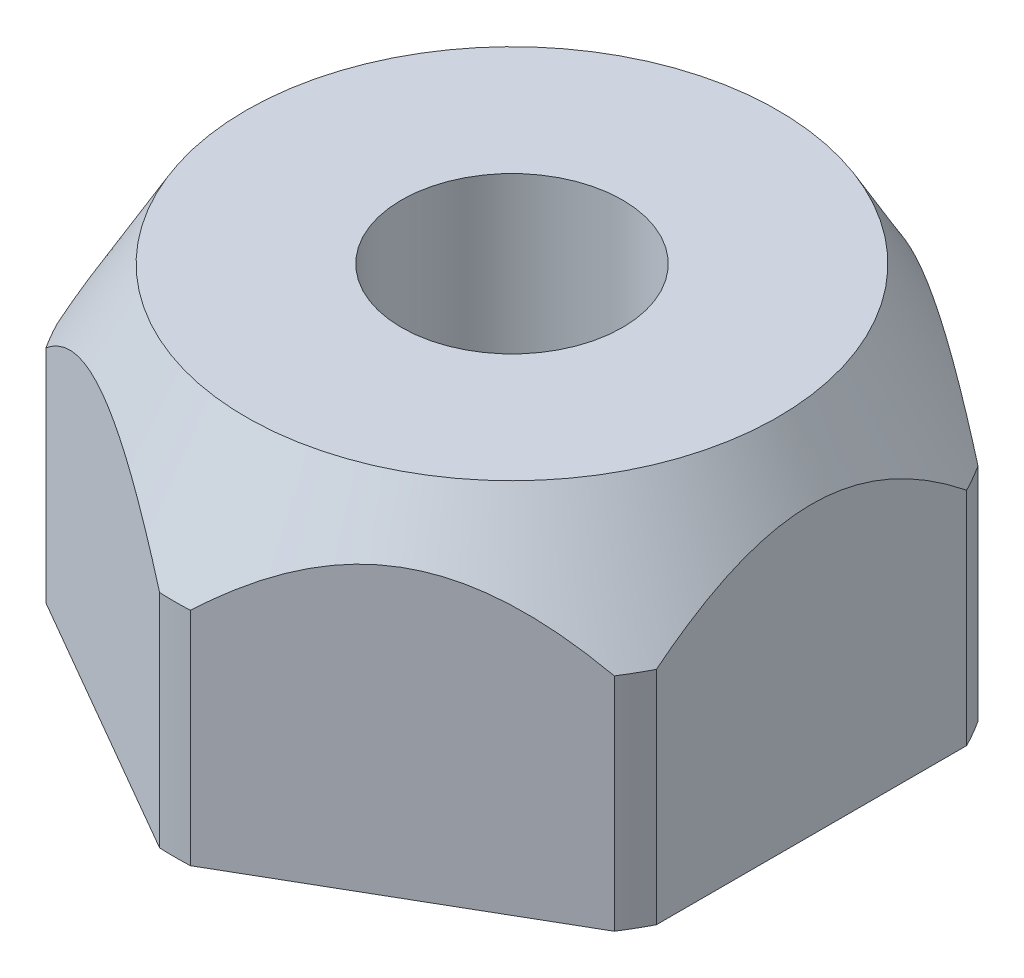
ISO-10303-21;
HEADER;
FILE_DESCRIPTION(('STEP AP214'),'2;1');
FILE_NAME('part.step','',(''),(''),'','','');
FILE_SCHEMA(('AUTOMOTIVE_DESIGN { 1 0 10303 214 1 1 1 1 }'));
ENDSEC;
DATA;
#1=APPLICATION_CONTEXT('core data for automotive mechanical design processes');
#2=APPLICATION_PROTOCOL_DEFINITION('international standard','automotive_design',2000,#1);
#3=PRODUCT_CONTEXT('',#1,'mechanical');
#4=PRODUCT('Part','Part','',(#3));
#5=PRODUCT_RELATED_PRODUCT_CATEGORY('part','',(#4));
#6=PRODUCT_DEFINITION_FORMATION('','',#4);
#7=PRODUCT_DEFINITION_CONTEXT('part definition',#1,'design');
#8=PRODUCT_DEFINITION('design','',#6,#7);
#9=PRODUCT_DEFINITION_SHAPE('','',#8);
#10=(LENGTH_UNIT() NAMED_UNIT(*) SI_UNIT(.MILLI.,.METRE.));
#11=(NAMED_UNIT(*) PLANE_ANGLE_UNIT() SI_UNIT($,.RADIAN.));
#12=(NAMED_UNIT(*) SI_UNIT($,.STERADIAN.) SOLID_ANGLE_UNIT());
#13=UNCERTAINTY_MEASURE_WITH_UNIT(LENGTH_MEASURE(1.E-05),#10,'distance_accuracy_value','');
#14=(GEOMETRIC_REPRESENTATION_CONTEXT(3) GLOBAL_UNCERTAINTY_ASSIGNED_CONTEXT((#13)) GLOBAL_UNIT_ASSIGNED_CONTEXT((#10,
#11,#12)) REPRESENTATION_CONTEXT('',''));
#15=CARTESIAN_POINT('',(0.,0.,0.));
#16=DIRECTION('',(0.,0.,1.));
#17=DIRECTION('',(1.,0.,0.));
#18=AXIS2_PLACEMENT_3D('',#15,#16,#17);
#19=CARTESIAN_POINT('',(0.,4.5212,0.));
#20=DIRECTION('',(0.,1.,0.));
#21=DIRECTION('',(-1.,0.,0.));
#22=AXIS2_PLACEMENT_3D('',#19,#20,#21);
#23=CYLINDRICAL_SURFACE('',#22,4.4196);
#24=DIRECTION('',(0.,1.,0.));
#25=VECTOR('',#24,1.);
#26=CARTESIAN_POINT('',(3.72270396182565,4.5212,-2.38208718828837));
#27=LINE('',#26,#25);
#28=CARTESIAN_POINT('',(3.72270396182565,2.89764571680006,-2.38208718828837));
#29=VERTEX_POINT('',#28);
#30=CARTESIAN_POINT('',(3.72270396182565,0.,-2.38208718828837));
#31=VERTEX_POINT('',#30);
#32=EDGE_CURVE('E202',#29,#31,#27,.F.);
#33=ORIENTED_EDGE('',*,*,#32,.F.);
#34=CARTESIAN_POINT('',(0.,2.89764571680006,0.));
#35=DIRECTION('',(0.,1.,0.));
#36=DIRECTION('',(-1.,0.,0.));
#37=AXIS2_PLACEMENT_3D('',#34,#35,#36);
#38=CIRCLE('',#37,4.4196);
#39=CARTESIAN_POINT('',(3.9243,2.89764571680006,-2.03291260756581));
#40=VERTEX_POINT('',#39);
#41=EDGE_CURVE('E177',#40,#29,#38,.T.);
#42=ORIENTED_EDGE('',*,*,#41,.F.);
#43=DIRECTION('',(0.,1.,0.));
#44=VECTOR('',#43,1.);
#45=CARTESIAN_POINT('',(3.9243,4.5212,-2.03291260756581));
#46=LINE('',#45,#44);
#47=CARTESIAN_POINT('',(3.9243,0.,-2.03291260756581));
#48=VERTEX_POINT('',#47);
#49=EDGE_CURVE('E159',#48,#40,#46,.T.);
#50=ORIENTED_EDGE('',*,*,#49,.F.);
#51=CARTESIAN_POINT('',(0.,0.,0.));
#52=DIRECTION('',(0.,1.,0.));
#53=DIRECTION('',(-1.,0.,0.));
#54=AXIS2_PLACEMENT_3D('',#51,#52,#53);
#55=CIRCLE('',#54,4.4196);
#56=EDGE_CURVE('E175',#48,#31,#55,.T.);
#57=ORIENTED_EDGE('',*,*,#56,.T.);
#58=EDGE_LOOP('',(#33,#42,#50,#57));
#59=FACE_BOUND('',#58,.T.);
#60=ADVANCED_FACE('F44',(#59),#23,.T.);
#61=DIRECTION('',(0.,1.,0.));
#62=VECTOR('',#61,1.);
#63=CARTESIAN_POINT('',(0.201596038174351,4.5212,-4.41499979585417));
#64=LINE('',#63,#62);
#65=CARTESIAN_POINT('',(0.201596038174351,0.,-4.41499979585417));
#66=VERTEX_POINT('',#65);
#67=CARTESIAN_POINT('',(0.201596038174351,2.89764571680006,-4.41499979585417));
#68=VERTEX_POINT('',#67);
#69=EDGE_CURVE('E246',#66,#68,#64,.T.);
#70=ORIENTED_EDGE('',*,*,#69,.F.);
#71=CARTESIAN_POINT('',(-0.201596038174352,0.,-4.41499979585417));
#72=VERTEX_POINT('',#71);
#73=EDGE_CURVE('E187',#66,#72,#55,.T.);
#74=ORIENTED_EDGE('',*,*,#73,.T.);
#75=DIRECTION('',(0.,1.,0.));
#76=VECTOR('',#75,1.);
#77=CARTESIAN_POINT('',(-0.201596038174351,4.5212,-4.41499979585417));
#78=LINE('',#77,#76);
#79=CARTESIAN_POINT('',(-0.201596038174351,2.89764571680006,-4.41499979585417));
#80=VERTEX_POINT('',#79);
#81=EDGE_CURVE('E73',#80,#72,#78,.F.);
#82=ORIENTED_EDGE('',*,*,#81,.F.);
#83=EDGE_CURVE('E322',#68,#80,#38,.T.);
#84=ORIENTED_EDGE('',*,*,#83,.F.);
#85=EDGE_LOOP('',(#70,#74,#82,#84));
#86=FACE_BOUND('',#85,.T.);
#87=ADVANCED_FACE('F284',(#86),#23,.T.);
#88=DIRECTION('',(0.,1.,0.));
#89=VECTOR('',#88,1.);
#90=CARTESIAN_POINT('',(-3.72270396182565,4.5212,-2.38208718828837));
#91=LINE('',#90,#89);
#92=CARTESIAN_POINT('',(-3.72270396182565,0.,-2.38208718828837));
#93=VERTEX_POINT('',#92);
#94=CARTESIAN_POINT('',(-3.72270396182565,2.89764571680006,-2.38208718828837));
#95=VERTEX_POINT('',#94);
#96=EDGE_CURVE('E231',#93,#95,#91,.T.);
#97=ORIENTED_EDGE('',*,*,#96,.F.);
#98=CARTESIAN_POINT('',(-3.9243,0.,-2.0329126075658));
#99=VERTEX_POINT('',#98);
#100=EDGE_CURVE('E195',#93,#99,#55,.T.);
#101=ORIENTED_EDGE('',*,*,#100,.T.);
#102=DIRECTION('',(0.,1.,0.));
#103=VECTOR('',#102,1.);
#104=CARTESIAN_POINT('',(-3.9243,4.5212,-2.0329126075658));
#105=LINE('',#104,#103);
#106=CARTESIAN_POINT('',(-3.9243,2.89764571680006,-2.0329126075658));
#107=VERTEX_POINT('',#106);
#108=EDGE_CURVE('E62',#107,#99,#105,.F.);
#109=ORIENTED_EDGE('',*,*,#108,.F.);
#110=EDGE_CURVE('E215',#95,#107,#38,.T.);
#111=ORIENTED_EDGE('',*,*,#110,.F.);
#112=EDGE_LOOP('',(#97,#101,#109,#111));
#113=FACE_BOUND('',#112,.T.);
#114=ADVANCED_FACE('F237',(#113),#23,.T.);
#115=DIRECTION('',(0.,1.,0.));
#116=VECTOR('',#115,1.);
#117=CARTESIAN_POINT('',(-3.9243,4.5212,2.0329126075658));
#118=LINE('',#117,#116);
#119=CARTESIAN_POINT('',(-3.9243,0.,2.0329126075658));
#120=VERTEX_POINT('',#119);
#121=CARTESIAN_POINT('',(-3.9243,2.89764571680005,2.03291260756582));
#122=VERTEX_POINT('',#121);
#123=EDGE_CURVE('E333',#120,#122,#118,.T.);
#124=ORIENTED_EDGE('',*,*,#123,.F.);
#125=CARTESIAN_POINT('',(-3.72270396182565,0.,2.38208718828837));
#126=VERTEX_POINT('',#125);
#127=EDGE_CURVE('E196',#120,#126,#55,.T.);
#128=ORIENTED_EDGE('',*,*,#127,.T.);
#129=DIRECTION('',(0.,1.,0.));
#130=VECTOR('',#129,1.);
#131=CARTESIAN_POINT('',(-3.72270396182565,4.5212,2.38208718828837));
#132=LINE('',#131,#130);
#133=CARTESIAN_POINT('',(-3.72270396182565,2.89764571680006,2.38208718828837));
#134=VERTEX_POINT('',#133);
#135=EDGE_CURVE('E320',#134,#126,#132,.F.);
#136=ORIENTED_EDGE('',*,*,#135,.F.);
#137=EDGE_CURVE('E169',#122,#134,#38,.T.);
#138=ORIENTED_EDGE('',*,*,#137,.F.);
#139=EDGE_LOOP('',(#124,#128,#136,#138));
#140=FACE_BOUND('',#139,.T.);
#141=ADVANCED_FACE('F295',(#140),#23,.T.);
#142=DIRECTION('',(0.,1.,0.));
#143=VECTOR('',#142,1.);
#144=CARTESIAN_POINT('',(-0.20159603817435,4.5212,4.41499979585417));
#145=LINE('',#144,#143);
#146=CARTESIAN_POINT('',(-0.201596038174349,0.,4.41499979585417));
#147=VERTEX_POINT('',#146);
#148=CARTESIAN_POINT('',(-0.20159603817435,2.89764571680006,4.41499979585417));
#149=VERTEX_POINT('',#148);
#150=EDGE_CURVE('E316',#147,#149,#145,.T.);
#151=ORIENTED_EDGE('',*,*,#150,.F.);
#152=CARTESIAN_POINT('',(0.201596038174345,0.,4.41499979585417));
#153=VERTEX_POINT('',#152);
#154=EDGE_CURVE('E192',#147,#153,#55,.T.);
#155=ORIENTED_EDGE('',*,*,#154,.T.);
#156=DIRECTION('',(0.,1.,0.));
#157=VECTOR('',#156,1.);
#158=CARTESIAN_POINT('',(0.201596038174346,4.5212,4.41499979585417));
#159=LINE('',#158,#157);
#160=CARTESIAN_POINT('',(0.201596038174346,2.89764571680006,4.41499979585417));
#161=VERTEX_POINT('',#160);
#162=EDGE_CURVE('E305',#161,#153,#159,.F.);
#163=ORIENTED_EDGE('',*,*,#162,.F.);
#164=EDGE_CURVE('E218',#149,#161,#38,.T.);
#165=ORIENTED_EDGE('',*,*,#164,.F.);
#166=EDGE_LOOP('',(#151,#155,#163,#165));
#167=FACE_BOUND('',#166,.T.);
#168=ADVANCED_FACE('F290',(#167),#23,.T.);
#169=DIRECTION('',(0.,1.,0.));
#170=VECTOR('',#169,1.);
#171=CARTESIAN_POINT('',(3.72270396182565,4.5212,2.38208718828837));
#172=LINE('',#171,#170);
#173=CARTESIAN_POINT('',(3.72270396182565,0.,2.38208718828837));
#174=VERTEX_POINT('',#173);
#175=CARTESIAN_POINT('',(3.72270396182565,2.89764571680006,2.38208718828837));
#176=VERTEX_POINT('',#175);
#177=EDGE_CURVE('E299',#174,#176,#172,.T.);
#178=ORIENTED_EDGE('',*,*,#177,.F.);
#179=CARTESIAN_POINT('',(3.9243,0.,2.03291260756581));
#180=VERTEX_POINT('',#179);
#181=EDGE_CURVE('E186',#174,#180,#55,.T.);
#182=ORIENTED_EDGE('',*,*,#181,.T.);
#183=DIRECTION('',(0.,1.,0.));
#184=VECTOR('',#183,1.);
#185=CARTESIAN_POINT('',(3.9243,4.5212,2.03291260756581));
#186=LINE('',#185,#184);
#187=CARTESIAN_POINT('',(3.9243,2.89764571680005,2.03291260756583));
#188=VERTEX_POINT('',#187);
#189=EDGE_CURVE('E162',#188,#180,#186,.F.);
#190=ORIENTED_EDGE('',*,*,#189,.F.);
#191=EDGE_CURVE('E301',#176,#188,#38,.T.);
#192=ORIENTED_EDGE('',*,*,#191,.F.);
#193=EDGE_LOOP('',(#178,#182,#190,#192));
#194=FACE_BOUND('',#193,.T.);
#195=ADVANCED_FACE('F46',(#194),#23,.T.);
#196=CARTESIAN_POINT('',(0.,4.5212,0.));
#197=DIRECTION('',(0.,-1.,0.));
#198=DIRECTION('',(1.,0.,0.));
#199=AXIS2_PLACEMENT_3D('',#196,#197,#198);
#200=CONICAL_SURFACE('',#199,3.48224049755053,0.523598775598307);
#201=CARTESIAN_POINT('',(0.201378646395307,2.89744571680006,-4.41512530705632));
#202=CARTESIAN_POINT('',(0.243002688833909,2.93573712645072,-4.39109365494964));
#203=CARTESIAN_POINT('',(0.285074251898576,2.97337922098922,-4.36680362668902));
#204=CARTESIAN_POINT('',(0.370206681949156,3.04717777314053,-4.31765239528255));
#205=CARTESIAN_POINT('',(0.413267908892586,3.08333367642834,-4.29279098431513));
#206=CARTESIAN_POINT('',(0.544599933654743,3.18971037495322,-4.21696640446548));
#207=CARTESIAN_POINT('',(0.634477673899376,3.25733473471823,-4.16507546694109));
#208=CARTESIAN_POINT('',(0.821144915873365,3.38487757851598,-4.05730308453852));
#209=CARTESIAN_POINT('',(0.918046421063457,3.44458078367558,-4.00135697443214));
#210=CARTESIAN_POINT('',(1.11680543627588,3.55102543367785,-3.88660340349538));
#211=CARTESIAN_POINT('',(1.218647548972,3.59780444515529,-3.82780483231544));
#212=CARTESIAN_POINT('',(1.43529451423899,3.67787617965486,-3.70272364859942));
#213=CARTESIAN_POINT('',(1.55048857316493,3.70981655679631,-3.63621632766949));
#214=CARTESIAN_POINT('',(1.78281413271054,3.74995513125242,-3.5020831033262));
#215=CARTESIAN_POINT('',(1.89991230733974,3.7584005945101,-3.43447644068241));
#216=CARTESIAN_POINT('',(2.13361293691471,3.75090530137457,-3.29954931928752));
#217=CARTESIAN_POINT('',(2.2502147736126,3.73493996899139,-3.23222921748199));
#218=CARTESIAN_POINT('',(2.4806112780335,3.68075542544333,-3.09920973363423));
#219=CARTESIAN_POINT('',(2.59436313462659,3.64230230903893,-3.0335350686094));
#220=CARTESIAN_POINT('',(2.79918417335044,3.55483104413837,-2.91528158676648));
#221=CARTESIAN_POINT('',(2.89107892955647,3.50829606479648,-2.86222612453382));
#222=CARTESIAN_POINT('',(3.07070088952971,3.40515033107087,-2.75852133759089));
#223=CARTESIAN_POINT('',(3.1584193246077,3.34851946739325,-2.70787707548573));
#224=CARTESIAN_POINT('',(3.32771219466592,3.22903572151362,-2.61013579138573));
#225=CARTESIAN_POINT('',(3.40938284458361,3.16636154115019,-2.56298321967086));
#226=CARTESIAN_POINT('',(3.56883955872649,3.03560761551068,-2.47092084283637));
#227=CARTESIAN_POINT('',(3.64664238475491,2.96755525608414,-2.42600136028515));
#228=CARTESIAN_POINT('',(3.7229213536047,2.89744571680005,-2.38196167708622));
#229=B_SPLINE_CURVE_WITH_KNOTS('',3,(#201,#202,#203,#204,#205,#206,#207,#208,#209,#210,#211,
#212,#213,#214,#215,#216,#217,#218,#219,#220,#221,#222,#223,#224,#225,#226,#227,#228),
.UNSPECIFIED.,.F.,.F.,(4,2,2,2,2,2,2,2,2,2,2,2,2,4),(0.,0.184345090143029,0.368758325377625,
0.739992068313383,1.11984200873029,1.49857594003078,1.90713875884581,2.3113852005117,
2.71603889232377,3.12497836793815,3.4719638581063,3.81964836787163,4.15911497599774,
4.49695241990035),.UNSPECIFIED.);
#230=EDGE_CURVE('E250',#68,#29,#229,.T.);
#231=ORIENTED_EDGE('',*,*,#230,.F.);
#232=ORIENTED_EDGE('',*,*,#83,.T.);
#233=CARTESIAN_POINT('',(-3.7229213536047,2.89744571680005,-2.38196167708622));
#234=CARTESIAN_POINT('',(-3.6812973111661,2.93573712645071,-2.4059933291929));
#235=CARTESIAN_POINT('',(-3.63922574810143,2.97337922098922,-2.43028335745352));
#236=CARTESIAN_POINT('',(-3.55409331805085,3.04717777314052,-2.47943458885999));
#237=CARTESIAN_POINT('',(-3.51103209110742,3.08333367642834,-2.50429599982741));
#238=CARTESIAN_POINT('',(-3.37970006634527,3.18971037495322,-2.58012057967706));
#239=CARTESIAN_POINT('',(-3.28982232610063,3.25733473471822,-2.63201151720146));
#240=CARTESIAN_POINT('',(-3.10315508412664,3.38487757851598,-2.73978389960402));
#241=CARTESIAN_POINT('',(-3.00625357893655,3.44458078367558,-2.7957300097104));
#242=CARTESIAN_POINT('',(-2.80749456372413,3.55102543367784,-2.91048358064716));
#243=CARTESIAN_POINT('',(-2.70565245102801,3.59780444515529,-2.9692821518271));
#244=CARTESIAN_POINT('',(-2.48900548576102,3.67787617965485,-3.09436333554312));
#245=CARTESIAN_POINT('',(-2.37381142683508,3.70981655679631,-3.16087065647305));
#246=CARTESIAN_POINT('',(-2.14148586728947,3.74995513125242,-3.29500388081634));
#247=CARTESIAN_POINT('',(-2.02438769266027,3.7584005945101,-3.36261054346013));
#248=CARTESIAN_POINT('',(-1.7906870630853,3.75090530137457,-3.49753766485502));
#249=CARTESIAN_POINT('',(-1.67408522638741,3.7349399689914,-3.56485776666055));
#250=CARTESIAN_POINT('',(-1.44368872196651,3.68075542544333,-3.69787725050831));
#251=CARTESIAN_POINT('',(-1.32993686537342,3.64230230903893,-3.76355191553314));
#252=CARTESIAN_POINT('',(-1.12511582664957,3.55483104413837,-3.88180539737606));
#253=CARTESIAN_POINT('',(-1.03322107044354,3.50829606479649,-3.93486085960873));
#254=CARTESIAN_POINT('',(-0.853599110470297,3.40515033107087,-4.03856564655165));
#255=CARTESIAN_POINT('',(-0.765880675392313,3.34851946739326,-4.08920990865681));
#256=CARTESIAN_POINT('',(-0.596587805334092,3.22903572151363,-4.18695119275681));
#257=CARTESIAN_POINT('',(-0.514917155416397,3.1663615411502,-4.23410376447168));
#258=CARTESIAN_POINT('',(-0.355460441273519,3.03560761551069,-4.32616614130617));
#259=CARTESIAN_POINT('',(-0.277657615245102,2.96755525608415,-4.37108562385739));
#260=CARTESIAN_POINT('',(-0.201378646395307,2.89744571680006,-4.41512530705632));
#261=B_SPLINE_CURVE_WITH_KNOTS('',3,(#233,#234,#235,#236,#237,#238,#239,#240,#241,#242,#243,
#244,#245,#246,#247,#248,#249,#250,#251,#252,#253,#254,#255,#256,#257,#258,#259,#260),
.UNSPECIFIED.,.F.,.F.,(4,2,2,2,2,2,2,2,2,2,2,2,2,4),(0.,0.184345090143029,0.368758325377625,
0.739992068313384,1.11984200873029,1.49857594003079,1.90713875884581,2.31138520051171,
2.71603889232377,3.12497836793816,3.4719638581063,3.81964836787163,4.15911497599774,
4.49695241990034),.UNSPECIFIED.);
#262=EDGE_CURVE('E240',#95,#80,#261,.T.);
#263=ORIENTED_EDGE('',*,*,#262,.F.);
#264=ORIENTED_EDGE('',*,*,#110,.T.);
#265=CARTESIAN_POINT('',(-3.9243,-5.87380782557374,-8.63379129520373));
#266=CARTESIAN_POINT('',(-3.9243,-5.58964286938288,-8.45355593513878));
#267=CARTESIAN_POINT('',(-3.9243,-5.30589522438469,-8.27265816557873));
#268=CARTESIAN_POINT('',(-3.9243,-4.73944838253155,-7.90919357757867));
#269=CARTESIAN_POINT('',(-3.9243,-4.45674924687053,-7.72662666381215));
#270=CARTESIAN_POINT('',(-3.9243,-3.89179400145961,-7.35894572743985));
#271=CARTESIAN_POINT('',(-3.9243,-3.60954180925933,-7.17382567678761));
#272=CARTESIAN_POINT('',(-3.9243,-3.04668309623803,-6.80111721439275));
#273=CARTESIAN_POINT('',(-3.9243,-2.76607652358586,-6.61352888100245));
#274=CARTESIAN_POINT('',(-3.9243,-2.17874914148297,-6.21618149631846));
#275=CARTESIAN_POINT('',(-3.9243,-1.8722493542194,-6.00609478205519));
#276=CARTESIAN_POINT('',(-3.9243,-1.2626331318594,-5.58099180262799));
#277=CARTESIAN_POINT('',(-3.9243,-0.959517050733292,-5.36597502878301));
#278=CARTESIAN_POINT('',(-3.9243,-0.35855230177701,-4.92970380860127));
#279=CARTESIAN_POINT('',(-3.9243,-0.060695582010741,-4.70846054388232));
#280=CARTESIAN_POINT('',(-3.9243,0.380757835234389,-4.36969669549216));
#281=CARTESIAN_POINT('',(-3.9243,0.527008292446811,-4.25563546669555));
#282=CARTESIAN_POINT('',(-3.9243,0.817287951568911,-4.02472547436633));
#283=CARTESIAN_POINT('',(-3.9243,0.961317270900784,-3.90787685902861));
#284=CARTESIAN_POINT('',(-3.9243,1.20900848594877,-3.70200165467747));
#285=CARTESIAN_POINT('',(-3.9243,1.31331413034915,-3.61375017193311));
#286=CARTESIAN_POINT('',(-3.9243,1.52007701334346,-3.43509629501821));
#287=CARTESIAN_POINT('',(-3.9243,1.62253419982915,-3.34469384037758));
#288=CARTESIAN_POINT('',(-3.9243,1.82537344432241,-3.16119172938196));
#289=CARTESIAN_POINT('',(-3.9243,1.92575108110659,-3.06808717133467));
#290=CARTESIAN_POINT('',(-3.9243,2.12365413528848,-2.87889417516989));
#291=CARTESIAN_POINT('',(-3.9243,2.22117972595293,-2.7828059190515));
#292=CARTESIAN_POINT('',(-3.9243,2.41081224427405,-2.5889155437287));
#293=CARTESIAN_POINT('',(-3.9243,2.50298659907945,-2.49117968490803));
#294=CARTESIAN_POINT('',(-3.9243,2.68287198547388,-2.29160114585912));
#295=CARTESIAN_POINT('',(-3.9243,2.77058166928826,-2.18975724194887));
#296=CARTESIAN_POINT('',(-3.9243,2.93981076454091,-1.98155789228631));
#297=CARTESIAN_POINT('',(-3.9243,3.02134917254444,-1.87521800513253));
#298=CARTESIAN_POINT('',(-3.9243,3.17649864518206,-1.65694963490632));
#299=CARTESIAN_POINT('',(-3.9243,3.25011654126105,-1.54502609171099));
#300=CARTESIAN_POINT('',(-3.9243,3.35948778615387,-1.36056405232588));
#301=CARTESIAN_POINT('',(-3.9243,3.3986581290361,-1.29005960112683));
#302=CARTESIAN_POINT('',(-3.9243,3.47231673158247,-1.14664541023704));
#303=CARTESIAN_POINT('',(-3.9243,3.50680414548727,-1.07373523900949));
#304=CARTESIAN_POINT('',(-3.9243,3.6017037872312,-0.85169513625506));
#305=CARTESIAN_POINT('',(-3.9243,3.65384598832468,-0.698783402481794));
#306=CARTESIAN_POINT('',(-3.9243,3.72125862440976,-0.414375721124633));
#307=CARTESIAN_POINT('',(-3.9243,3.74153228763838,-0.284085210312981));
#308=CARTESIAN_POINT('',(-3.9243,3.75920323472214,-0.0218768313064437));
#309=CARTESIAN_POINT('',(-3.9243,3.75660117281652,0.110040990240066));
#310=CARTESIAN_POINT('',(-3.9243,3.72894702535028,0.371034328665205));
#311=CARTESIAN_POINT('',(-3.9243,3.7039555252625,0.500116553480642));
#312=CARTESIAN_POINT('',(-3.9243,3.63493261062312,0.7529780698682));
#313=CARTESIAN_POINT('',(-3.9243,3.59089182871347,0.876754719503425));
#314=CARTESIAN_POINT('',(-3.9243,3.49432043207937,1.10314912209663));
#315=CARTESIAN_POINT('',(-3.9243,3.44347694361856,1.20650790848841));
#316=CARTESIAN_POINT('',(-3.9243,3.33293331391539,1.40842680911294));
#317=CARTESIAN_POINT('',(-3.9243,3.27322584092506,1.50698286031848));
#318=CARTESIAN_POINT('',(-3.9243,3.14635490565401,1.70065780687327));
#319=CARTESIAN_POINT('',(-3.9243,3.07911730261507,1.79572756015731));
#320=CARTESIAN_POINT('',(-3.9243,2.939351909161,1.98179076211418));
#321=CARTESIAN_POINT('',(-3.9243,2.86682665414167,2.07278613108027));
#322=CARTESIAN_POINT('',(-3.9243,2.72226307027854,2.24575017492362));
#323=CARTESIAN_POINT('',(-3.9243,2.65047395227167,2.32792855558461));
#324=CARTESIAN_POINT('',(-3.9243,2.50395662346823,2.48962939161582));
#325=CARTESIAN_POINT('',(-3.9243,2.42922801787163,2.56915148755219));
#326=CARTESIAN_POINT('',(-3.9243,2.20139453856917,2.80437018757481));
#327=CARTESIAN_POINT('',(-3.9243,2.04472951561085,2.95661718807237));
#328=CARTESIAN_POINT('',(-3.9243,1.72436552397984,3.25466769588499));
#329=CARTESIAN_POINT('',(-3.9243,1.56064217265613,3.40044462879705));
#330=CARTESIAN_POINT('',(-3.9243,1.2285037793297,3.6865751897645));
#331=CARTESIAN_POINT('',(-3.9243,1.06008811012746,3.82692808677206));
#332=CARTESIAN_POINT('',(-3.9243,0.733968216819453,4.09183149253688));
#333=CARTESIAN_POINT('',(-3.9243,0.57654059248636,4.21672433969304));
#334=CARTESIAN_POINT('',(-3.9243,0.259385992588557,4.46358469856286));
#335=CARTESIAN_POINT('',(-3.9243,0.0996587755311476,4.58555189939948));
#336=CARTESIAN_POINT('',(-3.9243,-0.22017094037556,4.82597958614242));
#337=CARTESIAN_POINT('',(-3.9243,-0.380257212293098,4.94446171729388));
#338=CARTESIAN_POINT('',(-3.9243,-0.701864312356236,5.17939164760606));
#339=CARTESIAN_POINT('',(-3.9243,-0.8633848263716,5.295839876429));
#340=CARTESIAN_POINT('',(-3.9243,-1.02548199442387,5.41146916723737));
#341=B_SPLINE_CURVE_WITH_KNOTS('',3,(#265,#266,#267,#268,#269,#270,#271,#272,#273,#274,#275,
#276,#277,#278,#279,#280,#281,#282,#283,#284,#285,#286,#287,#288,#289,#290,#291,#292,#293,#294,
#295,#296,#297,#298,#299,#300,#301,#302,#303,#304,#305,#306,#307,#308,#309,#310,#311,#312,#313,
#314,#315,#316,#317,#318,#319,#320,#321,#322,#323,#324,#325,#326,#327,#328,#329,#330,#331,#332,
#333,#334,#335,#336,#337,#338,#339,#340),.UNSPECIFIED.,.F.,.F.,(4,2,2,2,2,2,2,2,2,2,2,2,2,2,2,2,
2,2,2,2,2,2,2,2,2,2,2,2,2,2,2,2,2,2,2,2,2,4),(0.,1.00951269066253,2.01908340031431,
3.03170361538688,4.04429176336791,5.1590217229326,6.27386722200635,7.38682449596562,
7.94320958840621,8.49956516557767,8.90943405719607,9.31931448507023,9.72999171618565,
10.1406439458991,10.5435698771038,10.9466167290678,11.3483676832058,11.7497693011965,
11.9915734636186,12.2334212391062,12.7154641153318,13.1092420405207,13.5030087038095,
13.8957130483039,14.2886107224912,14.633659408222,14.9789951039688,15.3280929568146,
15.6770245065828,16.0042971625776,16.3316139253778,16.9866499157622,17.6441656189178,
18.3017696347011,18.9045859362486,19.5074660113789,20.1049366045304,20.7022794169288),.UNSPECIFIED.);
#342=EDGE_CURVE('E330',#122,#107,#341,.F.);
#343=ORIENTED_EDGE('',*,*,#342,.F.);
#344=ORIENTED_EDGE('',*,*,#137,.T.);
#345=CARTESIAN_POINT('',(-0.201378646395305,2.89744571680006,4.41512530705632));
#346=CARTESIAN_POINT('',(-0.243002688833907,2.93573712645072,4.39109365494964));
#347=CARTESIAN_POINT('',(-0.285074251898573,2.97337922098922,4.36680362668902));
#348=CARTESIAN_POINT('',(-0.370206681949154,3.04717777314053,4.31765239528255));
#349=CARTESIAN_POINT('',(-0.413267908892583,3.08333367642834,4.29279098431513));
#350=CARTESIAN_POINT('',(-0.544599933654741,3.18971037495322,4.21696640446548));
#351=CARTESIAN_POINT('',(-0.634477673899374,3.25733473471823,4.16507546694109));
#352=CARTESIAN_POINT('',(-0.821144915873363,3.38487757851598,4.05730308453852));
#353=CARTESIAN_POINT('',(-0.918046421063455,3.44458078367558,4.00135697443214));
#354=CARTESIAN_POINT('',(-1.11680543627588,3.55102543367785,3.88660340349538));
#355=CARTESIAN_POINT('',(-1.218647548972,3.59780444515529,3.82780483231544));
#356=CARTESIAN_POINT('',(-1.43529451423899,3.67787617965486,3.70272364859942));
#357=CARTESIAN_POINT('',(-1.55048857316493,3.70981655679631,3.63621632766949));
#358=CARTESIAN_POINT('',(-1.78281413271054,3.74995513125242,3.5020831033262));
#359=CARTESIAN_POINT('',(-1.89991230733974,3.7584005945101,3.43447644068242));
#360=CARTESIAN_POINT('',(-2.13361293691471,3.75090530137457,3.29954931928752));
#361=CARTESIAN_POINT('',(-2.2502147736126,3.7349399689914,3.23222921748199));
#362=CARTESIAN_POINT('',(-2.4806112780335,3.68075542544333,3.09920973363423));
#363=CARTESIAN_POINT('',(-2.59436313462658,3.64230230903892,3.0335350686094));
#364=CARTESIAN_POINT('',(-2.79918417335044,3.55483104413836,2.91528158676648));
#365=CARTESIAN_POINT('',(-2.89107892955647,3.50829606479648,2.86222612453382));
#366=CARTESIAN_POINT('',(-3.07070088952971,3.40515033107087,2.75852133759089));
#367=CARTESIAN_POINT('',(-3.1584193246077,3.34851946739325,2.70787707548573));
#368=CARTESIAN_POINT('',(-3.32771219466592,3.22903572151362,2.61013579138573));
#369=CARTESIAN_POINT('',(-3.40938284458361,3.16636154115019,2.56298321967086));
#370=CARTESIAN_POINT('',(-3.56883955872649,3.03560761551068,2.47092084283637));
#371=CARTESIAN_POINT('',(-3.64664238475491,2.96755525608414,2.42600136028515));
#372=CARTESIAN_POINT('',(-3.7229213536047,2.89744571680005,2.38196167708622));
#373=B_SPLINE_CURVE_WITH_KNOTS('',3,(#345,#346,#347,#348,#349,#350,#351,#352,#353,#354,#355,
#356,#357,#358,#359,#360,#361,#362,#363,#364,#365,#366,#367,#368,#369,#370,#371,#372),
.UNSPECIFIED.,.F.,.F.,(4,2,2,2,2,2,2,2,2,2,2,2,2,4),(0.,0.184345090143029,0.368758325377624,
0.739992068313383,1.11984200873029,1.49857594003079,1.90713875884581,2.3113852005117,
2.71603889232377,3.12497836793815,3.4719638581063,3.81964836787163,4.15911497599774,
4.49695241990035),.UNSPECIFIED.);
#374=EDGE_CURVE('E319',#149,#134,#373,.T.);
#375=ORIENTED_EDGE('',*,*,#374,.F.);
#376=ORIENTED_EDGE('',*,*,#164,.T.);
#377=CARTESIAN_POINT('',(3.72292135360471,2.89744571680005,2.38196167708621));
#378=CARTESIAN_POINT('',(3.6812973111661,2.93573712645071,2.4059933291929));
#379=CARTESIAN_POINT('',(3.63922574810144,2.97337922098922,2.43028335745351));
#380=CARTESIAN_POINT('',(3.55409331805086,3.04717777314052,2.47943458885998));
#381=CARTESIAN_POINT('',(3.51103209110743,3.08333367642834,2.50429599982741));
#382=CARTESIAN_POINT('',(3.37970006634527,3.18971037495322,2.58012057967706));
#383=CARTESIAN_POINT('',(3.28982232610064,3.25733473471822,2.63201151720145));
#384=CARTESIAN_POINT('',(3.10315508412665,3.38487757851598,2.73978389960402));
#385=CARTESIAN_POINT('',(3.00625357893656,3.44458078367558,2.7957300097104));
#386=CARTESIAN_POINT('',(2.80749456372413,3.55102543367785,2.91048358064716));
#387=CARTESIAN_POINT('',(2.70565245102802,3.59780444515529,2.9692821518271));
#388=CARTESIAN_POINT('',(2.48900548576102,3.67787617965486,3.09436333554311));
#389=CARTESIAN_POINT('',(2.37381142683508,3.70981655679631,3.16087065647305));
#390=CARTESIAN_POINT('',(2.14148586728947,3.74995513125242,3.29500388081634));
#391=CARTESIAN_POINT('',(2.02438769266027,3.7584005945101,3.36261054346012));
#392=CARTESIAN_POINT('',(1.7906870630853,3.75090530137457,3.49753766485501));
#393=CARTESIAN_POINT('',(1.67408522638741,3.7349399689914,3.56485776666055));
#394=CARTESIAN_POINT('',(1.44368872196651,3.68075542544334,3.6978772505083));
#395=CARTESIAN_POINT('',(1.32993686537343,3.64230230903893,3.76355191553314));
#396=CARTESIAN_POINT('',(1.12511582664957,3.55483104413837,3.88180539737606));
#397=CARTESIAN_POINT('',(1.03322107044354,3.50829606479649,3.93486085960872));
#398=CARTESIAN_POINT('',(0.853599110470297,3.40515033107088,4.03856564655164));
#399=CARTESIAN_POINT('',(0.765880675392313,3.34851946739326,4.08920990865681));
#400=CARTESIAN_POINT('',(0.596587805334091,3.22903572151363,4.18695119275681));
#401=CARTESIAN_POINT('',(0.514917155416395,3.1663615411502,4.23410376447168));
#402=CARTESIAN_POINT('',(0.355460441273515,3.03560761551069,4.32616614130617));
#403=CARTESIAN_POINT('',(0.277657615245097,2.96755525608415,4.37108562385739));
#404=CARTESIAN_POINT('',(0.201378646395302,2.89744571680006,4.41512530705632));
#405=B_SPLINE_CURVE_WITH_KNOTS('',3,(#377,#378,#379,#380,#381,#382,#383,#384,#385,#386,#387,
#388,#389,#390,#391,#392,#393,#394,#395,#396,#397,#398,#399,#400,#401,#402,#403,#404),
.UNSPECIFIED.,.F.,.F.,(4,2,2,2,2,2,2,2,2,2,2,2,2,4),(0.,0.184345090143029,0.368758325377625,
0.739992068313384,1.11984200873029,1.49857594003079,1.90713875884581,2.3113852005117,
2.71603889232377,3.12497836793816,3.4719638581063,3.81964836787163,4.15911497599774,
4.49695241990036),.UNSPECIFIED.);
#406=EDGE_CURVE('E306',#176,#161,#405,.T.);
#407=ORIENTED_EDGE('',*,*,#406,.F.);
#408=ORIENTED_EDGE('',*,*,#191,.T.);
#409=CARTESIAN_POINT('',(3.9243,-5.87380782557374,-8.63379129520373));
#410=CARTESIAN_POINT('',(3.9243,-5.58964286938288,-8.45355593513878));
#411=CARTESIAN_POINT('',(3.9243,-5.30589522438469,-8.27265816557873));
#412=CARTESIAN_POINT('',(3.9243,-4.73944838253155,-7.90919357757867));
#413=CARTESIAN_POINT('',(3.9243,-4.45674924687053,-7.72662666381215));
#414=CARTESIAN_POINT('',(3.9243,-3.89179400145961,-7.35894572743985));
#415=CARTESIAN_POINT('',(3.9243,-3.60954180925933,-7.17382567678761));
#416=CARTESIAN_POINT('',(3.9243,-3.04668309623803,-6.80111721439275));
#417=CARTESIAN_POINT('',(3.9243,-2.76607652358586,-6.61352888100245));
#418=CARTESIAN_POINT('',(3.9243,-2.17874914148296,-6.21618149631846));
#419=CARTESIAN_POINT('',(3.9243,-1.87224935421939,-6.00609478205518));
#420=CARTESIAN_POINT('',(3.9243,-1.26263313185939,-5.58099180262798));
#421=CARTESIAN_POINT('',(3.9243,-0.959517050733282,-5.365975028783));
#422=CARTESIAN_POINT('',(3.9243,-0.358552301776998,-4.92970380860126));
#423=CARTESIAN_POINT('',(3.9243,-0.0606955820107287,-4.70846054388231));
#424=CARTESIAN_POINT('',(3.9243,0.380757835234403,-4.36969669549215));
#425=CARTESIAN_POINT('',(3.9243,0.527008292446825,-4.25563546669554));
#426=CARTESIAN_POINT('',(3.9243,0.817287951568927,-4.02472547436632));
#427=CARTESIAN_POINT('',(3.9243,0.9613172709008,-3.9078768590286));
#428=CARTESIAN_POINT('',(3.9243,1.20900848594879,-3.70200165467746));
#429=CARTESIAN_POINT('',(3.9243,1.31331413034917,-3.6137501719331));
#430=CARTESIAN_POINT('',(3.9243,1.52007701334348,-3.4350962950182));
#431=CARTESIAN_POINT('',(3.9243,1.62253419982916,-3.34469384037757));
#432=CARTESIAN_POINT('',(3.9243,1.82537344432242,-3.16119172938195));
#433=CARTESIAN_POINT('',(3.9243,1.9257510811066,-3.06808717133467));
#434=CARTESIAN_POINT('',(3.9243,2.12365413528849,-2.87889417516988));
#435=CARTESIAN_POINT('',(3.9243,2.22117972595294,-2.7828059190515));
#436=CARTESIAN_POINT('',(3.9243,2.41081224427406,-2.5889155437287));
#437=CARTESIAN_POINT('',(3.9243,2.50298659907946,-2.49117968490802));
#438=CARTESIAN_POINT('',(3.9243,2.68287198547389,-2.29160114585911));
#439=CARTESIAN_POINT('',(3.9243,2.77058166928827,-2.18975724194887));
#440=CARTESIAN_POINT('',(3.9243,2.93981076454091,-1.98155789228631));
#441=CARTESIAN_POINT('',(3.9243,3.02134917254445,-1.87521800513252));
#442=CARTESIAN_POINT('',(3.9243,3.17649864518207,-1.65694963490632));
#443=CARTESIAN_POINT('',(3.9243,3.25011654126105,-1.54502609171099));
#444=CARTESIAN_POINT('',(3.9243,3.35948778615387,-1.36056405232588));
#445=CARTESIAN_POINT('',(3.9243,3.39865812903611,-1.29005960112683));
#446=CARTESIAN_POINT('',(3.9243,3.47231673158247,-1.14664541023704));
#447=CARTESIAN_POINT('',(3.9243,3.50680414548727,-1.07373523900949));
#448=CARTESIAN_POINT('',(3.9243,3.6017037872312,-0.851695136255063));
#449=CARTESIAN_POINT('',(3.9243,3.65384598832468,-0.698783402481796));
#450=CARTESIAN_POINT('',(3.9243,3.72125862440976,-0.414375721124635));
#451=CARTESIAN_POINT('',(3.9243,3.74153228763838,-0.284085210312983));
#452=CARTESIAN_POINT('',(3.9243,3.75920323472215,-0.0218768313064456));
#453=CARTESIAN_POINT('',(3.9243,3.75660117281652,0.110040990240064));
#454=CARTESIAN_POINT('',(3.9243,3.72894702535029,0.371034328665203));
#455=CARTESIAN_POINT('',(3.9243,3.70395552526251,0.50011655348064));
#456=CARTESIAN_POINT('',(3.9243,3.63493261062312,0.752978069868198));
#457=CARTESIAN_POINT('',(3.9243,3.59089182871347,0.876754719503423));
#458=CARTESIAN_POINT('',(3.9243,3.49432043207938,1.10314912209662));
#459=CARTESIAN_POINT('',(3.9243,3.44347694361857,1.20650790848841));
#460=CARTESIAN_POINT('',(3.9243,3.3329333139154,1.40842680911294));
#461=CARTESIAN_POINT('',(3.9243,3.27322584092506,1.50698286031847));
#462=CARTESIAN_POINT('',(3.9243,3.14635490565401,1.70065780687327));
#463=CARTESIAN_POINT('',(3.9243,3.07911730261507,1.79572756015731));
#464=CARTESIAN_POINT('',(3.9243,2.939351909161,1.98179076211418));
#465=CARTESIAN_POINT('',(3.9243,2.86682665414167,2.07278613108027));
#466=CARTESIAN_POINT('',(3.9243,2.72226307027855,2.24575017492362));
#467=CARTESIAN_POINT('',(3.9243,2.65047395227167,2.3279285555846));
#468=CARTESIAN_POINT('',(3.9243,2.50395662346824,2.48962939161582));
#469=CARTESIAN_POINT('',(3.9243,2.42922801787164,2.56915148755219));
#470=CARTESIAN_POINT('',(3.9243,2.20139453856917,2.80437018757481));
#471=CARTESIAN_POINT('',(3.9243,2.04472951561086,2.95661718807237));
#472=CARTESIAN_POINT('',(3.9243,1.72436552397985,3.25466769588499));
#473=CARTESIAN_POINT('',(3.9243,1.56064217265614,3.40044462879704));
#474=CARTESIAN_POINT('',(3.9243,1.22850377932971,3.68657518976449));
#475=CARTESIAN_POINT('',(3.9243,1.06008811012747,3.82692808677205));
#476=CARTESIAN_POINT('',(3.9243,0.733968216819467,4.09183149253687));
#477=CARTESIAN_POINT('',(3.9243,0.576540592486375,4.21672433969303));
#478=CARTESIAN_POINT('',(3.9243,0.259385992588573,4.46358469856285));
#479=CARTESIAN_POINT('',(3.9243,0.099658775531164,4.58555189939947));
#480=CARTESIAN_POINT('',(3.9243,-0.220170940375543,4.82597958614241));
#481=CARTESIAN_POINT('',(3.9243,-0.380257212293082,4.94446171729387));
#482=CARTESIAN_POINT('',(3.9243,-0.70186431235622,5.17939164760605));
#483=CARTESIAN_POINT('',(3.9243,-0.863384826371584,5.29583987642899));
#484=CARTESIAN_POINT('',(3.9243,-1.02548199442385,5.41146916723736));
#485=B_SPLINE_CURVE_WITH_KNOTS('',3,(#409,#410,#411,#412,#413,#414,#415,#416,#417,#418,#419,
#420,#421,#422,#423,#424,#425,#426,#427,#428,#429,#430,#431,#432,#433,#434,#435,#436,#437,#438,
#439,#440,#441,#442,#443,#444,#445,#446,#447,#448,#449,#450,#451,#452,#453,#454,#455,#456,#457,
#458,#459,#460,#461,#462,#463,#464,#465,#466,#467,#468,#469,#470,#471,#472,#473,#474,#475,#476,
#477,#478,#479,#480,#481,#482,#483,#484),.UNSPECIFIED.,.F.,.F.,(4,2,2,2,2,2,2,2,2,2,2,2,2,2,2,2,
2,2,2,2,2,2,2,2,2,2,2,2,2,2,2,2,2,2,2,2,2,4),(0.,1.00951269066253,2.01908340031431,
3.03170361538688,4.04429176336792,5.15902172293261,6.27386722200636,7.38682449596563,
7.94320958840624,8.49956516557769,8.90943405719609,9.31931448507025,9.72999171618567,
10.1406439458991,10.5435698771039,10.9466167290678,11.3483676832058,11.7497693011965,
11.9915734636186,12.2334212391062,12.7154641153318,13.1092420405207,13.5030087038095,
13.8957130483039,14.2886107224912,14.633659408222,14.9789951039688,15.3280929568146,
15.6770245065828,16.0042971625776,16.3316139253778,16.9866499157622,17.6441656189178,
18.3017696347011,18.9045859362486,19.5074660113789,20.1049366045304,20.7022794169288),.UNSPECIFIED.);
#486=EDGE_CURVE('E179',#40,#188,#485,.T.);
#487=ORIENTED_EDGE('',*,*,#486,.F.);
#488=ORIENTED_EDGE('',*,*,#41,.T.);
#489=EDGE_LOOP('',(#231,#232,#263,#264,#343,#344,#375,#376,#407,#408,#487,#488));
#490=FACE_BOUND('',#489,.T.);
#491=CARTESIAN_POINT('',(0.,4.5212,0.));
#492=DIRECTION('',(0.,1.,0.));
#493=DIRECTION('',(-1.,0.,0.));
#494=AXIS2_PLACEMENT_3D('',#491,#492,#493);
#495=CIRCLE('',#494,3.48224049755053);
#496=CARTESIAN_POINT('',(-3.48224049755052,4.5212,0.));
#497=VERTEX_POINT('',#496);
#498=EDGE_CURVE('E211',#497,#497,#495,.T.);
#499=ORIENTED_EDGE('',*,*,#498,.F.);
#500=EDGE_LOOP('',(#499));
#501=FACE_BOUND('',#500,.T.);
#502=ADVANCED_FACE('F260',(#490,#501),#200,.T.);
#503=CARTESIAN_POINT('',(-3.48224049755052,4.5212,0.));
#504=DIRECTION('',(0.,1.,0.));
#505=DIRECTION('',(-1.,0.,0.));
#506=AXIS2_PLACEMENT_3D('',#503,#504,#505);
#507=PLANE('',#506);
#508=ORIENTED_EDGE('',*,*,#498,.T.);
#509=EDGE_LOOP('',(#508));
#510=FACE_BOUND('',#509,.T.);
#511=CARTESIAN_POINT('',(0.,4.5212,0.));
#512=DIRECTION('',(0.,1.,0.));
#513=DIRECTION('',(-1.,0.,0.));
#514=AXIS2_PLACEMENT_3D('',#511,#512,#513);
#515=CIRCLE('',#514,1.4478);
#516=CARTESIAN_POINT('',(-1.4478,4.5212,0.));
#517=VERTEX_POINT('',#516);
#518=EDGE_CURVE('E207',#517,#517,#515,.T.);
#519=ORIENTED_EDGE('',*,*,#518,.F.);
#520=EDGE_LOOP('',(#519));
#521=FACE_BOUND('',#520,.T.);
#522=ADVANCED_FACE('F274',(#510,#521),#507,.T.);
#523=CARTESIAN_POINT('',(0.,4.5212,0.));
#524=DIRECTION('',(0.,1.,0.));
#525=DIRECTION('',(-1.,0.,0.));
#526=AXIS2_PLACEMENT_3D('',#523,#524,#525);
#527=CYLINDRICAL_SURFACE('',#526,1.4478);
#528=ORIENTED_EDGE('',*,*,#518,.T.);
#529=EDGE_LOOP('',(#528));
#530=FACE_BOUND('',#529,.T.);
#531=CARTESIAN_POINT('',(0.,0.,0.));
#532=DIRECTION('',(0.,1.,0.));
#533=DIRECTION('',(-1.,0.,0.));
#534=AXIS2_PLACEMENT_3D('',#531,#532,#533);
#535=CIRCLE('',#534,1.4478);
#536=CARTESIAN_POINT('',(-1.4478,0.,0.));
#537=VERTEX_POINT('',#536);
#538=EDGE_CURVE('E201',#537,#537,#535,.T.);
#539=ORIENTED_EDGE('',*,*,#538,.F.);
#540=EDGE_LOOP('',(#539));
#541=FACE_BOUND('',#540,.T.);
#542=ADVANCED_FACE('F272',(#530,#541),#527,.F.);
#543=CARTESIAN_POINT('',(-1.4478,0.,0.));
#544=DIRECTION('',(0.,-1.,0.));
#545=DIRECTION('',(1.,0.,0.));
#546=AXIS2_PLACEMENT_3D('',#543,#544,#545);
#547=PLANE('',#546);
#548=DIRECTION('',(-0.866025403784439,0.,-0.5));
#549=VECTOR('',#548,1.);
#550=CARTESIAN_POINT('',(0.876300000000001,0.,-4.02545928187083));
#551=LINE('',#550,#549);
#552=EDGE_CURVE('E11',#31,#66,#551,.T.);
#553=ORIENTED_EDGE('',*,*,#552,.F.);
#554=ORIENTED_EDGE('',*,*,#56,.F.);
#555=DIRECTION('',(0.,0.,-1.));
#556=VECTOR('',#555,1.);
#557=CARTESIAN_POINT('',(3.9243,0.,0.));
#558=LINE('',#557,#556);
#559=EDGE_CURVE('E156',#180,#48,#558,.T.);
#560=ORIENTED_EDGE('',*,*,#559,.F.);
#561=ORIENTED_EDGE('',*,*,#181,.F.);
#562=DIRECTION('',(0.866025403784439,0.,-0.5));
#563=VECTOR('',#562,1.);
#564=CARTESIAN_POINT('',(0.876299999999999,0.,4.02545928187083));
#565=LINE('',#564,#563);
#566=EDGE_CURVE('E168',#153,#174,#565,.T.);
#567=ORIENTED_EDGE('',*,*,#566,.F.);
#568=ORIENTED_EDGE('',*,*,#154,.F.);
#569=DIRECTION('',(0.866025403784439,0.,0.5));
#570=VECTOR('',#569,1.);
#571=CARTESIAN_POINT('',(-3.048,0.,2.77162770227172));
#572=LINE('',#571,#570);
#573=EDGE_CURVE('E222',#126,#147,#572,.T.);
#574=ORIENTED_EDGE('',*,*,#573,.F.);
#575=ORIENTED_EDGE('',*,*,#127,.F.);
#576=DIRECTION('',(0.,0.,1.));
#577=VECTOR('',#576,1.);
#578=CARTESIAN_POINT('',(-3.9243,0.,0.));
#579=LINE('',#578,#577);
#580=EDGE_CURVE('E225',#99,#120,#579,.T.);
#581=ORIENTED_EDGE('',*,*,#580,.F.);
#582=ORIENTED_EDGE('',*,*,#100,.F.);
#583=DIRECTION('',(-0.866025403784439,0.,0.5));
#584=VECTOR('',#583,1.);
#585=CARTESIAN_POINT('',(-3.048,0.,-2.77162770227172));
#586=LINE('',#585,#584);
#587=EDGE_CURVE('E53',#72,#93,#586,.T.);
#588=ORIENTED_EDGE('',*,*,#587,.F.);
#589=ORIENTED_EDGE('',*,*,#73,.F.);
#590=EDGE_LOOP('',(#553,#554,#560,#561,#567,#568,#574,#575,#581,#582,#588,#589));
#591=FACE_BOUND('',#590,.T.);
#592=ORIENTED_EDGE('',*,*,#538,.T.);
#593=EDGE_LOOP('',(#592));
#594=FACE_BOUND('',#593,.T.);
#595=ADVANCED_FACE('F182',(#591,#594),#547,.T.);
#596=CARTESIAN_POINT('',(3.9243,4.5212,2.26569566138085));
#597=DIRECTION('',(-1.,0.,0.));
#598=DIRECTION('',(0.,0.,1.));
#599=AXIS2_PLACEMENT_3D('',#596,#597,#598);
#600=PLANE('',#599);
#601=ORIENTED_EDGE('',*,*,#189,.T.);
#602=ORIENTED_EDGE('',*,*,#559,.T.);
#603=ORIENTED_EDGE('',*,*,#49,.T.);
#604=ORIENTED_EDGE('',*,*,#486,.T.);
#605=EDGE_LOOP('',(#601,#602,#603,#604));
#606=FACE_BOUND('',#605,.T.);
#607=ADVANCED_FACE('F158',(#606),#600,.F.);
#608=CARTESIAN_POINT('',(0.,4.5212,4.5313913227617));
#609=DIRECTION('',(-0.5,0.,-0.866025403784439));
#610=DIRECTION('',(-0.866025403784439,0.,0.5));
#611=AXIS2_PLACEMENT_3D('',#608,#609,#610);
#612=PLANE('',#611);
#613=ORIENTED_EDGE('',*,*,#162,.T.);
#614=ORIENTED_EDGE('',*,*,#566,.T.);
#615=ORIENTED_EDGE('',*,*,#177,.T.);
#616=ORIENTED_EDGE('',*,*,#406,.T.);
#617=EDGE_LOOP('',(#613,#614,#615,#616));
#618=FACE_BOUND('',#617,.T.);
#619=ADVANCED_FACE('F353',(#618),#612,.F.);
#620=CARTESIAN_POINT('',(-3.9243,4.5212,2.26569566138085));
#621=DIRECTION('',(0.5,0.,-0.866025403784439));
#622=DIRECTION('',(-0.866025403784439,0.,-0.5));
#623=AXIS2_PLACEMENT_3D('',#620,#621,#622);
#624=PLANE('',#623);
#625=ORIENTED_EDGE('',*,*,#135,.T.);
#626=ORIENTED_EDGE('',*,*,#573,.T.);
#627=ORIENTED_EDGE('',*,*,#150,.T.);
#628=ORIENTED_EDGE('',*,*,#374,.T.);
#629=EDGE_LOOP('',(#625,#626,#627,#628));
#630=FACE_BOUND('',#629,.T.);
#631=ADVANCED_FACE('F349',(#630),#624,.F.);
#632=CARTESIAN_POINT('',(-3.9243,4.5212,-2.26569566138085));
#633=DIRECTION('',(1.,0.,0.));
#634=DIRECTION('',(0.,0.,-1.));
#635=AXIS2_PLACEMENT_3D('',#632,#633,#634);
#636=PLANE('',#635);
#637=ORIENTED_EDGE('',*,*,#108,.T.);
#638=ORIENTED_EDGE('',*,*,#580,.T.);
#639=ORIENTED_EDGE('',*,*,#123,.T.);
#640=ORIENTED_EDGE('',*,*,#342,.T.);
#641=EDGE_LOOP('',(#637,#638,#639,#640));
#642=FACE_BOUND('',#641,.T.);
#643=ADVANCED_FACE('F345',(#642),#636,.F.);
#644=CARTESIAN_POINT('',(0.,4.5212,-4.5313913227617));
#645=DIRECTION('',(0.5,0.,0.866025403784439));
#646=DIRECTION('',(0.866025403784439,0.,-0.5));
#647=AXIS2_PLACEMENT_3D('',#644,#645,#646);
#648=PLANE('',#647);
#649=ORIENTED_EDGE('',*,*,#81,.T.);
#650=ORIENTED_EDGE('',*,*,#587,.T.);
#651=ORIENTED_EDGE('',*,*,#96,.T.);
#652=ORIENTED_EDGE('',*,*,#262,.T.);
#653=EDGE_LOOP('',(#649,#650,#651,#652));
#654=FACE_BOUND('',#653,.T.);
#655=ADVANCED_FACE('F230',(#654),#648,.F.);
#656=CARTESIAN_POINT('',(3.9243,4.5212,-2.26569566138085));
#657=DIRECTION('',(-0.5,0.,0.866025403784439));
#658=DIRECTION('',(0.866025403784439,0.,0.5));
#659=AXIS2_PLACEMENT_3D('',#656,#657,#658);
#660=PLANE('',#659);
#661=ORIENTED_EDGE('',*,*,#32,.T.);
#662=ORIENTED_EDGE('',*,*,#552,.T.);
#663=ORIENTED_EDGE('',*,*,#69,.T.);
#664=ORIENTED_EDGE('',*,*,#230,.T.);
#665=EDGE_LOOP('',(#661,#662,#663,#664));
#666=FACE_BOUND('',#665,.T.);
#667=ADVANCED_FACE('F263',(#666),#660,.F.);
#668=CLOSED_SHELL('',(#60,#87,#114,#141,#168,#195,#502,#522,#542,#595,#607,#619,#631,#643,#655,#667));
#669=MANIFOLD_SOLID_BREP('B2',#668);
#670=ADVANCED_BREP_SHAPE_REPRESENTATION('',(#18,#669),#14);
#671=SHAPE_DEFINITION_REPRESENTATION(#9,#670);
ENDSEC;
END-ISO-10303-21;
